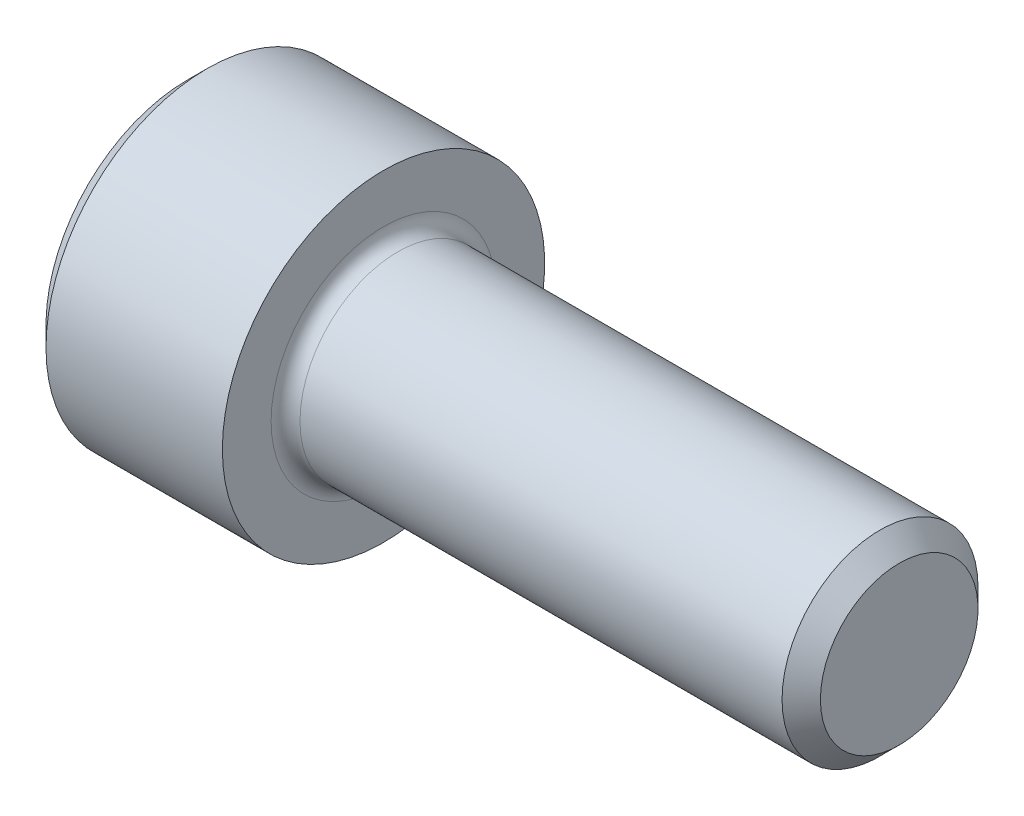
ISO-10303-21;
HEADER;
FILE_DESCRIPTION(('STEP AP214'),'2;1');
FILE_NAME('part.step','',(''),(''),'','','');
FILE_SCHEMA(('AUTOMOTIVE_DESIGN { 1 0 10303 214 1 1 1 1 }'));
ENDSEC;
DATA;
#1=APPLICATION_CONTEXT('core data for automotive mechanical design processes');
#2=APPLICATION_PROTOCOL_DEFINITION('international standard','automotive_design',2000,#1);
#3=PRODUCT_CONTEXT('',#1,'mechanical');
#4=PRODUCT('Part','Part','',(#3));
#5=PRODUCT_RELATED_PRODUCT_CATEGORY('part','',(#4));
#6=PRODUCT_DEFINITION_FORMATION('','',#4);
#7=PRODUCT_DEFINITION_CONTEXT('part definition',#1,'design');
#8=PRODUCT_DEFINITION('design','',#6,#7);
#9=PRODUCT_DEFINITION_SHAPE('','',#8);
#10=(LENGTH_UNIT() NAMED_UNIT(*) SI_UNIT(.MILLI.,.METRE.));
#11=(NAMED_UNIT(*) PLANE_ANGLE_UNIT() SI_UNIT($,.RADIAN.));
#12=(NAMED_UNIT(*) SI_UNIT($,.STERADIAN.) SOLID_ANGLE_UNIT());
#13=UNCERTAINTY_MEASURE_WITH_UNIT(LENGTH_MEASURE(1.E-05),#10,'distance_accuracy_value','');
#14=(GEOMETRIC_REPRESENTATION_CONTEXT(3) GLOBAL_UNCERTAINTY_ASSIGNED_CONTEXT((#13)) GLOBAL_UNIT_ASSIGNED_CONTEXT((#10,
#11,#12)) REPRESENTATION_CONTEXT('',''));
#15=CARTESIAN_POINT('',(0.,0.,0.));
#16=DIRECTION('',(0.,0.,1.));
#17=DIRECTION('',(1.,0.,0.));
#18=AXIS2_PLACEMENT_3D('',#15,#16,#17);
#19=CARTESIAN_POINT('',(2.286,1.14604605784411,1.98501));
#20=DIRECTION('',(-1.,0.,0.));
#21=DIRECTION('',(0.,0.,1.));
#22=AXIS2_PLACEMENT_3D('',#19,#20,#21);
#23=PLANE('',#22);
#24=DIRECTION('',(0.,0.500000000000001,0.866025403784438));
#25=VECTOR('',#24,1.);
#26=CARTESIAN_POINT('',(2.286,-1.71906908676614,0.992505));
#27=LINE('',#26,#25);
#28=CARTESIAN_POINT('',(2.2859999999804,-1.71906908679011,0.992505000013839));
#29=VERTEX_POINT('',#28);
#30=CARTESIAN_POINT('',(2.286,-1.14604605784409,1.98501));
#31=VERTEX_POINT('',#30);
#32=EDGE_CURVE('E100',#29,#31,#27,.T.);
#33=ORIENTED_EDGE('',*,*,#32,.T.);
#34=DIRECTION('',(0.,1.,0.));
#35=VECTOR('',#34,1.);
#36=CARTESIAN_POINT('',(2.286,1.14604605784411,1.98501));
#37=LINE('',#36,#35);
#38=CARTESIAN_POINT('',(2.28599999998701,0.,1.98501000001309));
#39=VERTEX_POINT('',#38);
#40=EDGE_CURVE('E95',#31,#39,#37,.T.);
#41=ORIENTED_EDGE('',*,*,#40,.T.);
#42=CARTESIAN_POINT('',(2.2859999999608,0.,0.));
#43=DIRECTION('',(-1.,0.,0.));
#44=DIRECTION('',(0.,0.,1.));
#45=AXIS2_PLACEMENT_3D('',#42,#43,#44);
#46=CIRCLE('',#45,1.98501000005535);
#47=EDGE_CURVE('E97',#39,#29,#46,.F.);
#48=ORIENTED_EDGE('',*,*,#47,.T.);
#49=EDGE_LOOP('',(#33,#41,#48));
#50=FACE_BOUND('',#49,.T.);
#51=ADVANCED_FACE('F16',(#50),#23,.T.);
#52=CARTESIAN_POINT('',(2.286,1.14604605784411,1.98501));
#53=DIRECTION('',(-1.,0.,0.));
#54=DIRECTION('',(0.,0.,1.));
#55=AXIS2_PLACEMENT_3D('',#52,#53,#54);
#56=PLANE('',#55);
#57=DIRECTION('',(0.,-0.499999999999998,0.86602540378444));
#58=VECTOR('',#57,1.);
#59=CARTESIAN_POINT('',(2.286,-1.71906908676615,-0.992504999999996));
#60=LINE('',#59,#58);
#61=CARTESIAN_POINT('',(2.2859999999804,-1.71906908679012,-0.992505000013836));
#62=VERTEX_POINT('',#61);
#63=CARTESIAN_POINT('',(2.286,-2.29209211568819,0.));
#64=VERTEX_POINT('',#63);
#65=EDGE_CURVE('E104',#62,#64,#60,.T.);
#66=ORIENTED_EDGE('',*,*,#65,.T.);
#67=DIRECTION('',(0.,0.500000000000001,0.866025403784438));
#68=VECTOR('',#67,1.);
#69=CARTESIAN_POINT('',(2.286,-2.29209211568819,0.));
#70=LINE('',#69,#68);
#71=EDGE_CURVE('E171',#64,#29,#70,.T.);
#72=ORIENTED_EDGE('',*,*,#71,.T.);
#73=CARTESIAN_POINT('',(2.2859999999608,0.,0.));
#74=DIRECTION('',(-1.,0.,0.));
#75=DIRECTION('',(0.,0.,1.));
#76=AXIS2_PLACEMENT_3D('',#73,#74,#75);
#77=CIRCLE('',#76,1.98501000005535);
#78=EDGE_CURVE('E116',#29,#62,#77,.F.);
#79=ORIENTED_EDGE('',*,*,#78,.T.);
#80=EDGE_LOOP('',(#66,#72,#79));
#81=FACE_BOUND('',#80,.T.);
#82=ADVANCED_FACE('F347',(#81),#56,.T.);
#83=CARTESIAN_POINT('',(2.286,1.14604605784411,1.98501));
#84=DIRECTION('',(-1.,0.,0.));
#85=DIRECTION('',(0.,0.,1.));
#86=AXIS2_PLACEMENT_3D('',#83,#84,#85);
#87=PLANE('',#86);
#88=DIRECTION('',(0.,1.,0.));
#89=VECTOR('',#88,1.);
#90=CARTESIAN_POINT('',(2.286,1.14604605784411,-1.98501));
#91=LINE('',#90,#89);
#92=CARTESIAN_POINT('',(2.28599999998701,0.,-1.98501000001309));
#93=VERTEX_POINT('',#92);
#94=CARTESIAN_POINT('',(2.286,-1.1460460578441,-1.98501));
#95=VERTEX_POINT('',#94);
#96=EDGE_CURVE('E166',#93,#95,#91,.F.);
#97=ORIENTED_EDGE('',*,*,#96,.T.);
#98=DIRECTION('',(0.,-0.499999999999999,0.866025403784439));
#99=VECTOR('',#98,1.);
#100=CARTESIAN_POINT('',(2.286,-1.1460460578441,-1.98501));
#101=LINE('',#100,#99);
#102=EDGE_CURVE('E161',#95,#62,#101,.T.);
#103=ORIENTED_EDGE('',*,*,#102,.T.);
#104=CARTESIAN_POINT('',(2.2859999999608,0.,0.));
#105=DIRECTION('',(-1.,0.,0.));
#106=DIRECTION('',(0.,0.,1.));
#107=AXIS2_PLACEMENT_3D('',#104,#105,#106);
#108=CIRCLE('',#107,1.98501000005535);
#109=EDGE_CURVE('E224',#62,#93,#108,.F.);
#110=ORIENTED_EDGE('',*,*,#109,.T.);
#111=EDGE_LOOP('',(#97,#103,#110));
#112=FACE_BOUND('',#111,.T.);
#113=ADVANCED_FACE('F344',(#112),#87,.T.);
#114=CARTESIAN_POINT('',(2.286,1.14604605784411,1.98501));
#115=DIRECTION('',(-1.,0.,0.));
#116=DIRECTION('',(0.,0.,1.));
#117=AXIS2_PLACEMENT_3D('',#114,#115,#116);
#118=PLANE('',#117);
#119=DIRECTION('',(0.,-0.500000000000001,-0.866025403784438));
#120=VECTOR('',#119,1.);
#121=CARTESIAN_POINT('',(2.286,1.71906908676615,-0.992505000000006));
#122=LINE('',#121,#120);
#123=CARTESIAN_POINT('',(2.2859999999804,1.71906908679012,-0.992505000013843));
#124=VERTEX_POINT('',#123);
#125=CARTESIAN_POINT('',(2.286,1.1460460578441,-1.98501));
#126=VERTEX_POINT('',#125);
#127=EDGE_CURVE('E156',#124,#126,#122,.T.);
#128=ORIENTED_EDGE('',*,*,#127,.T.);
#129=DIRECTION('',(0.,1.,0.));
#130=VECTOR('',#129,1.);
#131=CARTESIAN_POINT('',(2.286,1.14604605784411,-1.98501));
#132=LINE('',#131,#130);
#133=EDGE_CURVE('E151',#126,#93,#132,.F.);
#134=ORIENTED_EDGE('',*,*,#133,.T.);
#135=CARTESIAN_POINT('',(2.2859999999608,0.,0.));
#136=DIRECTION('',(-1.,0.,0.));
#137=DIRECTION('',(0.,0.,1.));
#138=AXIS2_PLACEMENT_3D('',#135,#136,#137);
#139=CIRCLE('',#138,1.98501000005535);
#140=EDGE_CURVE('E221',#93,#124,#139,.F.);
#141=ORIENTED_EDGE('',*,*,#140,.T.);
#142=EDGE_LOOP('',(#128,#134,#141));
#143=FACE_BOUND('',#142,.T.);
#144=ADVANCED_FACE('F340',(#143),#118,.T.);
#145=CARTESIAN_POINT('',(2.286,1.14604605784411,1.98501));
#146=DIRECTION('',(-1.,0.,0.));
#147=DIRECTION('',(0.,0.,1.));
#148=AXIS2_PLACEMENT_3D('',#145,#146,#147);
#149=PLANE('',#148);
#150=DIRECTION('',(0.,0.500000000000002,-0.866025403784437));
#151=VECTOR('',#150,1.);
#152=CARTESIAN_POINT('',(2.286,1.71906908676615,0.992504999999996));
#153=LINE('',#152,#151);
#154=CARTESIAN_POINT('',(2.2859999999804,1.71906908679012,0.992505000013835));
#155=VERTEX_POINT('',#154);
#156=CARTESIAN_POINT('',(2.286,2.2920921156882,0.));
#157=VERTEX_POINT('',#156);
#158=EDGE_CURVE('E146',#155,#157,#153,.T.);
#159=ORIENTED_EDGE('',*,*,#158,.T.);
#160=DIRECTION('',(0.,-0.500000000000002,-0.866025403784437));
#161=VECTOR('',#160,1.);
#162=CARTESIAN_POINT('',(2.286,2.2920921156882,0.));
#163=LINE('',#162,#161);
#164=EDGE_CURVE('E117',#157,#124,#163,.T.);
#165=ORIENTED_EDGE('',*,*,#164,.T.);
#166=CARTESIAN_POINT('',(2.2859999999608,0.,0.));
#167=DIRECTION('',(-1.,0.,0.));
#168=DIRECTION('',(0.,0.,1.));
#169=AXIS2_PLACEMENT_3D('',#166,#167,#168);
#170=CIRCLE('',#169,1.98501000005535);
#171=EDGE_CURVE('E124',#124,#155,#170,.F.);
#172=ORIENTED_EDGE('',*,*,#171,.T.);
#173=EDGE_LOOP('',(#159,#165,#172));
#174=FACE_BOUND('',#173,.T.);
#175=ADVANCED_FACE('F336',(#174),#149,.T.);
#176=CARTESIAN_POINT('',(2.28600000002643,0.,0.));
#177=DIRECTION('',(-1.,0.,0.));
#178=DIRECTION('',(0.,0.,1.));
#179=AXIS2_PLACEMENT_3D('',#176,#177,#178);
#180=CONICAL_SURFACE('',#179,1.98500999994167,1.04719755112655);
#181=CARTESIAN_POINT('',(3.43204605781011,0.,5.6843418860808E-11));
#182=VERTEX_POINT('',#181);
#183=VERTEX_LOOP('',#182);
#184=FACE_BOUND('',#183,.T.);
#185=ORIENTED_EDGE('',*,*,#47,.F.);
#186=CARTESIAN_POINT('',(2.2859999999608,0.,0.));
#187=DIRECTION('',(-1.,0.,0.));
#188=DIRECTION('',(0.,0.,1.));
#189=AXIS2_PLACEMENT_3D('',#186,#187,#188);
#190=CIRCLE('',#189,1.98501000005535);
#191=EDGE_CURVE('E112',#155,#39,#190,.F.);
#192=ORIENTED_EDGE('',*,*,#191,.F.);
#193=ORIENTED_EDGE('',*,*,#171,.F.);
#194=ORIENTED_EDGE('',*,*,#140,.F.);
#195=ORIENTED_EDGE('',*,*,#109,.F.);
#196=ORIENTED_EDGE('',*,*,#78,.F.);
#197=EDGE_LOOP('',(#185,#192,#193,#194,#195,#196));
#198=FACE_BOUND('',#197,.T.);
#199=ADVANCED_FACE('F110',(#184,#198),#180,.F.);
#200=CARTESIAN_POINT('',(2.286,1.14604605784411,1.98501));
#201=DIRECTION('',(-1.,0.,0.));
#202=DIRECTION('',(0.,0.,1.));
#203=AXIS2_PLACEMENT_3D('',#200,#201,#202);
#204=PLANE('',#203);
#205=DIRECTION('',(0.,-1.,0.));
#206=VECTOR('',#205,1.);
#207=CARTESIAN_POINT('',(2.286,-1.14604605784409,1.98501));
#208=LINE('',#207,#206);
#209=CARTESIAN_POINT('',(2.286,1.14604605784411,1.98501));
#210=VERTEX_POINT('',#209);
#211=EDGE_CURVE('E121',#39,#210,#208,.F.);
#212=ORIENTED_EDGE('',*,*,#211,.T.);
#213=DIRECTION('',(0.,0.499999999999998,-0.86602540378444));
#214=VECTOR('',#213,1.);
#215=CARTESIAN_POINT('',(2.286,2.2920921156882,0.));
#216=LINE('',#215,#214);
#217=EDGE_CURVE('E123',#155,#210,#216,.F.);
#218=ORIENTED_EDGE('',*,*,#217,.F.);
#219=ORIENTED_EDGE('',*,*,#191,.T.);
#220=EDGE_LOOP('',(#212,#218,#219));
#221=FACE_BOUND('',#220,.T.);
#222=ADVANCED_FACE('F120',(#221),#204,.T.);
#223=CARTESIAN_POINT('',(2.286,2.2920921156882,0.));
#224=DIRECTION('',(0.,-0.86602540378444,-0.499999999999998));
#225=DIRECTION('',(0.,0.499999999999998,-0.86602540378444));
#226=AXIS2_PLACEMENT_3D('',#223,#224,#225);
#227=PLANE('',#226);
#228=ORIENTED_EDGE('',*,*,#217,.T.);
#229=DIRECTION('',(1.,0.,0.));
#230=VECTOR('',#229,1.);
#231=CARTESIAN_POINT('',(2.286,1.14604605784411,1.98501));
#232=LINE('',#231,#230);
#233=CARTESIAN_POINT('',(0.,1.14604605784411,1.98501));
#234=VERTEX_POINT('',#233);
#235=EDGE_CURVE('E129',#210,#234,#232,.F.);
#236=ORIENTED_EDGE('',*,*,#235,.T.);
#237=DIRECTION('',(0.,-0.499999999999998,0.86602540378444));
#238=VECTOR('',#237,1.);
#239=CARTESIAN_POINT('',(0.,2.2920921156882,0.));
#240=LINE('',#239,#238);
#241=CARTESIAN_POINT('',(0.,2.2920921156882,0.));
#242=VERTEX_POINT('',#241);
#243=EDGE_CURVE('E136',#242,#234,#240,.T.);
#244=ORIENTED_EDGE('',*,*,#243,.F.);
#245=DIRECTION('',(1.,0.,0.));
#246=VECTOR('',#245,1.);
#247=CARTESIAN_POINT('',(2.286,2.2920921156882,0.));
#248=LINE('',#247,#246);
#249=EDGE_CURVE('E186',#242,#157,#248,.T.);
#250=ORIENTED_EDGE('',*,*,#249,.T.);
#251=ORIENTED_EDGE('',*,*,#158,.F.);
#252=EDGE_LOOP('',(#228,#236,#244,#250,#251));
#253=FACE_BOUND('',#252,.T.);
#254=ADVANCED_FACE('F328',(#253),#227,.T.);
#255=CARTESIAN_POINT('',(2.286,-1.14604605784409,1.98501));
#256=DIRECTION('',(0.,0.,1.));
#257=DIRECTION('',(0.,-1.,0.));
#258=AXIS2_PLACEMENT_3D('',#255,#256,#257);
#259=PLANE('',#258);
#260=ORIENTED_EDGE('',*,*,#235,.F.);
#261=ORIENTED_EDGE('',*,*,#211,.F.);
#262=ORIENTED_EDGE('',*,*,#40,.F.);
#263=DIRECTION('',(1.,0.,0.));
#264=VECTOR('',#263,1.);
#265=CARTESIAN_POINT('',(2.286,-1.14604605784409,1.98501));
#266=LINE('',#265,#264);
#267=CARTESIAN_POINT('',(0.,-1.14604605784409,1.98501));
#268=VERTEX_POINT('',#267);
#269=EDGE_CURVE('E131',#268,#31,#266,.T.);
#270=ORIENTED_EDGE('',*,*,#269,.F.);
#271=DIRECTION('',(0.,1.,0.));
#272=VECTOR('',#271,1.);
#273=CARTESIAN_POINT('',(0.,0.,1.98501));
#274=LINE('',#273,#272);
#275=EDGE_CURVE('E362',#234,#268,#274,.F.);
#276=ORIENTED_EDGE('',*,*,#275,.F.);
#277=EDGE_LOOP('',(#260,#261,#262,#270,#276));
#278=FACE_BOUND('',#277,.T.);
#279=ADVANCED_FACE('F127',(#278),#259,.F.);
#280=CARTESIAN_POINT('',(2.286,-1.14604605784409,1.98501));
#281=DIRECTION('',(0.,0.866025403784438,-0.500000000000001));
#282=DIRECTION('',(0.,0.500000000000001,0.866025403784438));
#283=AXIS2_PLACEMENT_3D('',#280,#281,#282);
#284=PLANE('',#283);
#285=ORIENTED_EDGE('',*,*,#71,.F.);
#286=DIRECTION('',(1.,0.,0.));
#287=VECTOR('',#286,1.);
#288=CARTESIAN_POINT('',(2.286,-2.29209211568819,0.));
#289=LINE('',#288,#287);
#290=CARTESIAN_POINT('',(0.,-2.29209211568819,0.));
#291=VERTEX_POINT('',#290);
#292=EDGE_CURVE('E197',#291,#64,#289,.T.);
#293=ORIENTED_EDGE('',*,*,#292,.F.);
#294=DIRECTION('',(0.,-0.500000000000001,-0.866025403784438));
#295=VECTOR('',#294,1.);
#296=CARTESIAN_POINT('',(0.,-1.14604605784409,1.98501));
#297=LINE('',#296,#295);
#298=EDGE_CURVE('E360',#268,#291,#297,.T.);
#299=ORIENTED_EDGE('',*,*,#298,.F.);
#300=ORIENTED_EDGE('',*,*,#269,.T.);
#301=ORIENTED_EDGE('',*,*,#32,.F.);
#302=EDGE_LOOP('',(#285,#293,#299,#300,#301));
#303=FACE_BOUND('',#302,.T.);
#304=ADVANCED_FACE('F321',(#303),#284,.T.);
#305=CARTESIAN_POINT('',(2.286,-2.29209211568819,0.));
#306=DIRECTION('',(0.,0.866025403784439,0.499999999999999));
#307=DIRECTION('',(0.,-0.499999999999999,0.866025403784439));
#308=AXIS2_PLACEMENT_3D('',#305,#306,#307);
#309=PLANE('',#308);
#310=ORIENTED_EDGE('',*,*,#102,.F.);
#311=DIRECTION('',(1.,0.,0.));
#312=VECTOR('',#311,1.);
#313=CARTESIAN_POINT('',(2.286,-1.1460460578441,-1.98501));
#314=LINE('',#313,#312);
#315=CARTESIAN_POINT('',(0.,-1.1460460578441,-1.98501));
#316=VERTEX_POINT('',#315);
#317=EDGE_CURVE('E190',#95,#316,#314,.F.);
#318=ORIENTED_EDGE('',*,*,#317,.T.);
#319=DIRECTION('',(0.,0.499999999999999,-0.86602540378444));
#320=VECTOR('',#319,1.);
#321=CARTESIAN_POINT('',(0.,-2.29209211568819,0.));
#322=LINE('',#321,#320);
#323=EDGE_CURVE('E357',#291,#316,#322,.T.);
#324=ORIENTED_EDGE('',*,*,#323,.F.);
#325=ORIENTED_EDGE('',*,*,#292,.T.);
#326=ORIENTED_EDGE('',*,*,#65,.F.);
#327=EDGE_LOOP('',(#310,#318,#324,#325,#326));
#328=FACE_BOUND('',#327,.T.);
#329=ADVANCED_FACE('F317',(#328),#309,.T.);
#330=CARTESIAN_POINT('',(2.286,1.1460460578441,-1.98501));
#331=DIRECTION('',(0.,0.,-1.));
#332=DIRECTION('',(0.,1.,0.));
#333=AXIS2_PLACEMENT_3D('',#330,#331,#332);
#334=PLANE('',#333);
#335=ORIENTED_EDGE('',*,*,#317,.F.);
#336=ORIENTED_EDGE('',*,*,#96,.F.);
#337=ORIENTED_EDGE('',*,*,#133,.F.);
#338=DIRECTION('',(1.,0.,0.));
#339=VECTOR('',#338,1.);
#340=CARTESIAN_POINT('',(2.286,1.1460460578441,-1.98501));
#341=LINE('',#340,#339);
#342=CARTESIAN_POINT('',(0.,1.1460460578441,-1.98501));
#343=VERTEX_POINT('',#342);
#344=EDGE_CURVE('E189',#126,#343,#341,.F.);
#345=ORIENTED_EDGE('',*,*,#344,.T.);
#346=DIRECTION('',(0.,1.,0.));
#347=VECTOR('',#346,1.);
#348=CARTESIAN_POINT('',(0.,0.,-1.98501));
#349=LINE('',#348,#347);
#350=EDGE_CURVE('E372',#316,#343,#349,.T.);
#351=ORIENTED_EDGE('',*,*,#350,.F.);
#352=EDGE_LOOP('',(#335,#336,#337,#345,#351));
#353=FACE_BOUND('',#352,.T.);
#354=ADVANCED_FACE('F313',(#353),#334,.F.);
#355=CARTESIAN_POINT('',(2.286,2.2920921156882,0.));
#356=DIRECTION('',(0.,0.866025403784438,-0.500000000000002));
#357=DIRECTION('',(0.,0.500000000000002,0.866025403784438));
#358=AXIS2_PLACEMENT_3D('',#355,#356,#357);
#359=PLANE('',#358);
#360=ORIENTED_EDGE('',*,*,#344,.F.);
#361=ORIENTED_EDGE('',*,*,#127,.F.);
#362=ORIENTED_EDGE('',*,*,#164,.F.);
#363=ORIENTED_EDGE('',*,*,#249,.F.);
#364=DIRECTION('',(0.,0.500000000000002,0.866025403784438));
#365=VECTOR('',#364,1.);
#366=CARTESIAN_POINT('',(0.,1.1460460578441,-1.98501));
#367=LINE('',#366,#365);
#368=EDGE_CURVE('E217',#343,#242,#367,.T.);
#369=ORIENTED_EDGE('',*,*,#368,.F.);
#370=EDGE_LOOP('',(#360,#361,#362,#363,#369));
#371=FACE_BOUND('',#370,.T.);
#372=ADVANCED_FACE('F309',(#371),#359,.F.);
#373=CARTESIAN_POINT('',(0.,0.,0.));
#374=DIRECTION('',(-1.,0.,0.));
#375=DIRECTION('',(0.,0.,1.));
#376=AXIS2_PLACEMENT_3D('',#373,#374,#375);
#377=PLANE('',#376);
#378=CARTESIAN_POINT('',(-5.6843418860808E-11,0.,0.));
#379=DIRECTION('',(1.,0.,0.));
#380=DIRECTION('',(0.,1.,0.));
#381=AXIS2_PLACEMENT_3D('',#378,#379,#380);
#382=CIRCLE('',#381,3.48615000001473);
#383=CARTESIAN_POINT('',(-5.68434426698877E-11,3.48615000001473,0.));
#384=VERTEX_POINT('',#383);
#385=EDGE_CURVE('E215',#384,#384,#382,.T.);
#386=ORIENTED_EDGE('',*,*,#385,.F.);
#387=EDGE_LOOP('',(#386));
#388=FACE_BOUND('',#387,.T.);
#389=ORIENTED_EDGE('',*,*,#350,.T.);
#390=ORIENTED_EDGE('',*,*,#368,.T.);
#391=ORIENTED_EDGE('',*,*,#243,.T.);
#392=ORIENTED_EDGE('',*,*,#275,.T.);
#393=ORIENTED_EDGE('',*,*,#298,.T.);
#394=ORIENTED_EDGE('',*,*,#323,.T.);
#395=EDGE_LOOP('',(#389,#390,#391,#392,#393,#394));
#396=FACE_BOUND('',#395,.T.);
#397=ADVANCED_FACE('F301',(#388,#396),#377,.T.);
#398=CARTESIAN_POINT('',(0.482599999998001,0.,0.));
#399=DIRECTION('',(1.,0.,0.));
#400=DIRECTION('',(0.,1.,0.));
#401=AXIS2_PLACEMENT_3D('',#398,#399,#400);
#402=CONICAL_SURFACE('',#401,3.96875000006958,0.785398163397448);
#403=ORIENTED_EDGE('',*,*,#385,.T.);
#404=EDGE_LOOP('',(#403));
#405=FACE_BOUND('',#404,.T.);
#406=CARTESIAN_POINT('',(0.4826,0.,0.));
#407=DIRECTION('',(-1.,0.,0.));
#408=DIRECTION('',(0.,0.,1.));
#409=AXIS2_PLACEMENT_3D('',#406,#407,#408);
#410=CIRCLE('',#409,3.96875);
#411=CARTESIAN_POINT('',(0.4826,0.,3.96875));
#412=VERTEX_POINT('',#411);
#413=EDGE_CURVE('E214',#412,#412,#410,.F.);
#414=ORIENTED_EDGE('',*,*,#413,.F.);
#415=EDGE_LOOP('',(#414));
#416=FACE_BOUND('',#415,.T.);
#417=ADVANCED_FACE('F296',(#405,#416),#402,.T.);
#418=CARTESIAN_POINT('',(-31.75,0.,0.));
#419=DIRECTION('',(-1.,0.,0.));
#420=DIRECTION('',(0.,0.,1.));
#421=AXIS2_PLACEMENT_3D('',#418,#419,#420);
#422=CYLINDRICAL_SURFACE('',#421,3.96875);
#423=CARTESIAN_POINT('',(4.826,0.,0.));
#424=DIRECTION('',(-1.,0.,0.));
#425=DIRECTION('',(0.,0.,1.));
#426=AXIS2_PLACEMENT_3D('',#423,#424,#425);
#427=CIRCLE('',#426,3.96875);
#428=CARTESIAN_POINT('',(4.826,0.,3.96875));
#429=VERTEX_POINT('',#428);
#430=EDGE_CURVE('E211',#429,#429,#427,.F.);
#431=ORIENTED_EDGE('',*,*,#430,.F.);
#432=EDGE_LOOP('',(#431));
#433=FACE_BOUND('',#432,.T.);
#434=ORIENTED_EDGE('',*,*,#413,.T.);
#435=EDGE_LOOP('',(#434));
#436=FACE_BOUND('',#435,.T.);
#437=ADVANCED_FACE('F292',(#433,#436),#422,.T.);
#438=CARTESIAN_POINT('',(17.526,1.94056,0.));
#439=DIRECTION('',(1.,0.,0.));
#440=DIRECTION('',(0.,0.,-1.));
#441=AXIS2_PLACEMENT_3D('',#438,#439,#440);
#442=PLANE('',#441);
#443=CARTESIAN_POINT('',(17.5259999999753,0.,0.));
#444=DIRECTION('',(-1.,0.,0.));
#445=DIRECTION('',(0.,0.,1.));
#446=AXIS2_PLACEMENT_3D('',#443,#444,#445);
#447=CIRCLE('',#446,1.94055999998);
#448=CARTESIAN_POINT('',(17.5259999999753,0.,1.94055999998));
#449=VERTEX_POINT('',#448);
#450=EDGE_CURVE('E207',#449,#449,#447,.T.);
#451=ORIENTED_EDGE('',*,*,#450,.F.);
#452=EDGE_LOOP('',(#451));
#453=FACE_BOUND('',#452,.T.);
#454=ADVANCED_FACE('F250',(#453),#442,.T.);
#455=CARTESIAN_POINT('',(4.826,3.96875,0.));
#456=DIRECTION('',(1.,0.,0.));
#457=DIRECTION('',(0.,0.,-1.));
#458=AXIS2_PLACEMENT_3D('',#455,#456,#457);
#459=PLANE('',#458);
#460=ORIENTED_EDGE('',*,*,#430,.T.);
#461=EDGE_LOOP('',(#460));
#462=FACE_BOUND('',#461,.T.);
#463=CARTESIAN_POINT('',(4.826,0.,0.));
#464=DIRECTION('',(1.,0.,0.));
#465=DIRECTION('',(0.,0.,1.));
#466=AXIS2_PLACEMENT_3D('',#463,#464,#465);
#467=CIRCLE('',#466,2.76859999999999);
#468=CARTESIAN_POINT('',(4.826,0.,-2.76859999999999));
#469=VERTEX_POINT('',#468);
#470=CARTESIAN_POINT('',(4.826,0.,2.76859999999999));
#471=VERTEX_POINT('',#470);
#472=EDGE_CURVE('E210',#469,#471,#467,.F.);
#473=ORIENTED_EDGE('',*,*,#472,.T.);
#474=CARTESIAN_POINT('',(4.826,0.,0.));
#475=DIRECTION('',(1.,0.,0.));
#476=DIRECTION('',(0.,0.,-1.));
#477=AXIS2_PLACEMENT_3D('',#474,#475,#476);
#478=CIRCLE('',#477,2.76859999999999);
#479=EDGE_CURVE('E35',#471,#469,#478,.F.);
#480=ORIENTED_EDGE('',*,*,#479,.T.);
#481=EDGE_LOOP('',(#473,#480));
#482=FACE_BOUND('',#481,.T.);
#483=ADVANCED_FACE('F231',(#462,#482),#459,.T.);
#484=CARTESIAN_POINT('',(17.0535599999084,0.,0.));
#485=DIRECTION('',(-1.,0.,0.));
#486=DIRECTION('',(0.,0.,1.));
#487=AXIS2_PLACEMENT_3D('',#484,#485,#486);
#488=CONICAL_SURFACE('',#487,2.41299999999001,0.785398163337289);
#489=CARTESIAN_POINT('',(17.05356,0.,0.));
#490=DIRECTION('',(-1.,0.,0.));
#491=DIRECTION('',(0.,0.,1.));
#492=AXIS2_PLACEMENT_3D('',#489,#490,#491);
#493=CIRCLE('',#492,2.41299999999999);
#494=CARTESIAN_POINT('',(17.05356,0.,2.41299999999999));
#495=VERTEX_POINT('',#494);
#496=EDGE_CURVE('E27',#495,#495,#493,.T.);
#497=ORIENTED_EDGE('',*,*,#496,.F.);
#498=EDGE_LOOP('',(#497));
#499=FACE_BOUND('',#498,.T.);
#500=ORIENTED_EDGE('',*,*,#450,.T.);
#501=EDGE_LOOP('',(#500));
#502=FACE_BOUND('',#501,.T.);
#503=ADVANCED_FACE('F249',(#499,#502),#488,.T.);
#504=CARTESIAN_POINT('',(5.1816,0.,0.));
#505=DIRECTION('',(1.,0.,0.));
#506=DIRECTION('',(0.,0.,-1.));
#507=AXIS2_PLACEMENT_3D('',#504,#505,#506);
#508=TOROIDAL_SURFACE('',#507,2.76859999999999,0.3556);
#509=CARTESIAN_POINT('',(5.1816,0.,0.));
#510=DIRECTION('',(-1.,0.,0.));
#511=DIRECTION('',(0.,0.,1.));
#512=AXIS2_PLACEMENT_3D('',#509,#510,#511);
#513=CIRCLE('',#512,2.41299999999999);
#514=CARTESIAN_POINT('',(5.1816,0.,2.41299999999999));
#515=VERTEX_POINT('',#514);
#516=EDGE_CURVE('E11',#515,#515,#513,.F.);
#517=ORIENTED_EDGE('',*,*,#516,.F.);
#518=EDGE_LOOP('',(#517));
#519=FACE_BOUND('',#518,.T.);
#520=ORIENTED_EDGE('',*,*,#472,.F.);
#521=ORIENTED_EDGE('',*,*,#479,.F.);
#522=EDGE_LOOP('',(#520,#521));
#523=FACE_BOUND('',#522,.T.);
#524=ADVANCED_FACE('F228',(#519,#523),#508,.F.);
#525=CARTESIAN_POINT('',(-31.75,0.,0.));
#526=DIRECTION('',(-1.,0.,0.));
#527=DIRECTION('',(0.,0.,1.));
#528=AXIS2_PLACEMENT_3D('',#525,#526,#527);
#529=CYLINDRICAL_SURFACE('',#528,2.41299999999999);
#530=ORIENTED_EDGE('',*,*,#516,.T.);
#531=EDGE_LOOP('',(#530));
#532=FACE_BOUND('',#531,.T.);
#533=ORIENTED_EDGE('',*,*,#496,.T.);
#534=EDGE_LOOP('',(#533));
#535=FACE_BOUND('',#534,.T.);
#536=ADVANCED_FACE('F274',(#532,#535),#529,.T.);
#537=CLOSED_SHELL('',(#51,#82,#113,#144,#175,#199,#222,#254,#279,#304,#329,#354,#372,#397,#417,
#437,#454,#483,#503,#524,#536));
#538=MANIFOLD_SOLID_BREP('B1',#537);
#539=ADVANCED_BREP_SHAPE_REPRESENTATION('',(#18,#538),#14);
#540=SHAPE_DEFINITION_REPRESENTATION(#9,#539);
ENDSEC;
END-ISO-10303-21;
